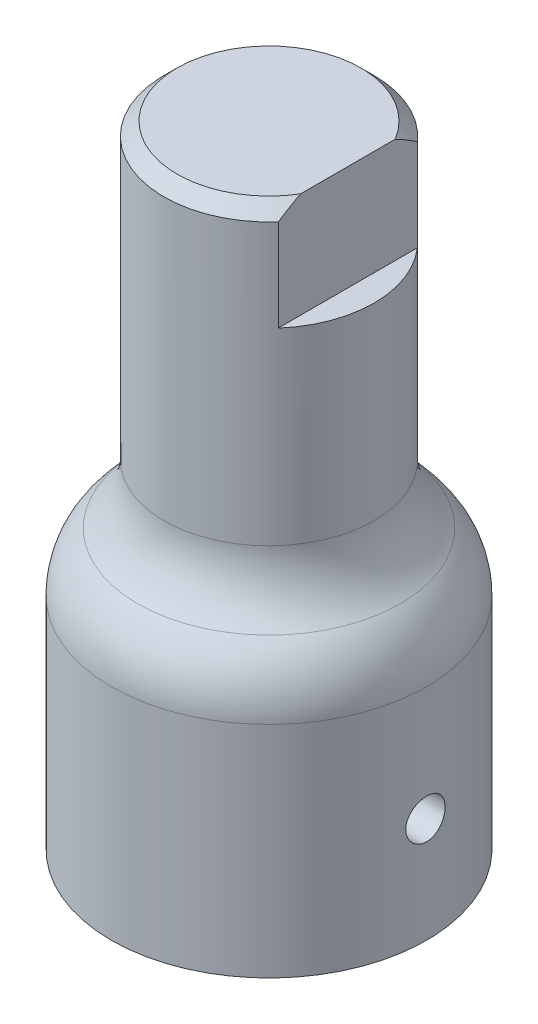
ISO-10303-21;
HEADER;
FILE_DESCRIPTION(('STEP AP214'),'2;1');
FILE_NAME('part.step','',(''),(''),'','','');
FILE_SCHEMA(('AUTOMOTIVE_DESIGN { 1 0 10303 214 1 1 1 1 }'));
ENDSEC;
DATA;
#1=APPLICATION_CONTEXT('core data for automotive mechanical design processes');
#2=APPLICATION_PROTOCOL_DEFINITION('international standard','automotive_design',2000,#1);
#3=PRODUCT_CONTEXT('',#1,'mechanical');
#4=PRODUCT('Part','Part','',(#3));
#5=PRODUCT_RELATED_PRODUCT_CATEGORY('part','',(#4));
#6=PRODUCT_DEFINITION_FORMATION('','',#4);
#7=PRODUCT_DEFINITION_CONTEXT('part definition',#1,'design');
#8=PRODUCT_DEFINITION('design','',#6,#7);
#9=PRODUCT_DEFINITION_SHAPE('','',#8);
#10=(LENGTH_UNIT() NAMED_UNIT(*) SI_UNIT(.MILLI.,.METRE.));
#11=(NAMED_UNIT(*) PLANE_ANGLE_UNIT() SI_UNIT($,.RADIAN.));
#12=(NAMED_UNIT(*) SI_UNIT($,.STERADIAN.) SOLID_ANGLE_UNIT());
#13=UNCERTAINTY_MEASURE_WITH_UNIT(LENGTH_MEASURE(1.E-05),#10,'distance_accuracy_value','');
#14=(GEOMETRIC_REPRESENTATION_CONTEXT(3) GLOBAL_UNCERTAINTY_ASSIGNED_CONTEXT((#13)) GLOBAL_UNIT_ASSIGNED_CONTEXT((#10,
#11,#12)) REPRESENTATION_CONTEXT('',''));
#15=CARTESIAN_POINT('',(0.,0.,0.));
#16=DIRECTION('',(0.,0.,1.));
#17=DIRECTION('',(1.,0.,0.));
#18=AXIS2_PLACEMENT_3D('',#15,#16,#17);
#19=CARTESIAN_POINT('',(0.,38.1,0.));
#20=DIRECTION('',(0.,-1.,0.));
#21=DIRECTION('',(0.,0.,-1.));
#22=AXIS2_PLACEMENT_3D('',#19,#20,#21);
#23=CYLINDRICAL_SURFACE('',#22,6.35);
#24=CARTESIAN_POINT('',(0.,20.3651280605346,0.));
#25=DIRECTION('',(0.,-1.,0.));
#26=DIRECTION('',(0.,0.,-1.));
#27=AXIS2_PLACEMENT_3D('',#24,#25,#26);
#28=CIRCLE('',#27,6.35);
#29=CARTESIAN_POINT('',(0.,20.3651280605346,-6.35));
#30=VERTEX_POINT('',#29);
#31=EDGE_CURVE('E149',#30,#30,#28,.F.);
#32=ORIENTED_EDGE('',*,*,#31,.T.);
#33=EDGE_LOOP('',(#32));
#34=FACE_BOUND('',#33,.T.);
#35=DIRECTION('',(0.,1.,0.));
#36=VECTOR('',#35,1.);
#37=CARTESIAN_POINT('',(4.7625,31.75,4.20013020631504));
#38=LINE('',#37,#36);
#39=CARTESIAN_POINT('',(4.7625,31.75,4.20013020631504));
#40=VERTEX_POINT('',#39);
#41=CARTESIAN_POINT('',(4.7625,37.30625,4.20013020631504));
#42=VERTEX_POINT('',#41);
#43=EDGE_CURVE('E82',#40,#42,#38,.T.);
#44=ORIENTED_EDGE('',*,*,#43,.T.);
#45=CARTESIAN_POINT('',(0.,37.30625,0.));
#46=DIRECTION('',(0.,1.,0.));
#47=DIRECTION('',(0.,0.,1.));
#48=AXIS2_PLACEMENT_3D('',#45,#46,#47);
#49=CIRCLE('',#48,6.35);
#50=CARTESIAN_POINT('',(4.7625,37.30625,-4.20013020631504));
#51=VERTEX_POINT('',#50);
#52=EDGE_CURVE('E11',#42,#51,#49,.F.);
#53=ORIENTED_EDGE('',*,*,#52,.T.);
#54=DIRECTION('',(0.,1.,0.));
#55=VECTOR('',#54,1.);
#56=CARTESIAN_POINT('',(4.7625,31.75,-4.20013020631504));
#57=LINE('',#56,#55);
#58=CARTESIAN_POINT('',(4.7625,31.75,-4.20013020631504));
#59=VERTEX_POINT('',#58);
#60=EDGE_CURVE('E80',#59,#51,#57,.T.);
#61=ORIENTED_EDGE('',*,*,#60,.F.);
#62=CARTESIAN_POINT('',(0.,31.75,0.));
#63=DIRECTION('',(0.,1.,0.));
#64=DIRECTION('',(0.,0.,1.));
#65=AXIS2_PLACEMENT_3D('',#62,#63,#64);
#66=CIRCLE('',#65,6.35);
#67=EDGE_CURVE('E85',#40,#59,#66,.T.);
#68=ORIENTED_EDGE('',*,*,#67,.F.);
#69=EDGE_LOOP('',(#44,#53,#61,#68));
#70=FACE_BOUND('',#69,.T.);
#71=ADVANCED_FACE('F35',(#34,#70),#23,.T.);
#72=CARTESIAN_POINT('',(0.,38.1,0.));
#73=DIRECTION('',(0.,1.,0.));
#74=DIRECTION('',(0.,0.,1.));
#75=AXIS2_PLACEMENT_3D('',#72,#73,#74);
#76=PLANE('',#75);
#77=DIRECTION('',(0.,0.,-1.));
#78=VECTOR('',#77,1.);
#79=CARTESIAN_POINT('',(4.7625,38.1,4.20013020631504));
#80=LINE('',#79,#78);
#81=CARTESIAN_POINT('',(4.7625,38.1,2.86190632489952));
#82=VERTEX_POINT('',#81);
#83=CARTESIAN_POINT('',(4.7625,38.1,-2.86190632489951));
#84=VERTEX_POINT('',#83);
#85=EDGE_CURVE('E88',#82,#84,#80,.T.);
#86=ORIENTED_EDGE('',*,*,#85,.T.);
#87=CARTESIAN_POINT('',(0.,38.1,0.));
#88=DIRECTION('',(0.,1.,0.));
#89=DIRECTION('',(0.,0.,1.));
#90=AXIS2_PLACEMENT_3D('',#87,#88,#89);
#91=CIRCLE('',#90,5.55624999999999);
#92=EDGE_CURVE('E165',#84,#82,#91,.T.);
#93=ORIENTED_EDGE('',*,*,#92,.T.);
#94=EDGE_LOOP('',(#86,#93));
#95=FACE_BOUND('',#94,.T.);
#96=ADVANCED_FACE('F141',(#95),#76,.T.);
#97=CARTESIAN_POINT('',(0.,0.,0.));
#98=DIRECTION('',(0.,1.,0.));
#99=DIRECTION('',(0.,0.,1.));
#100=AXIS2_PLACEMENT_3D('',#97,#98,#99);
#101=PLANE('',#100);
#102=CARTESIAN_POINT('',(0.,0.,0.));
#103=DIRECTION('',(0.,1.,0.));
#104=DIRECTION('',(0.,0.,1.));
#105=AXIS2_PLACEMENT_3D('',#102,#103,#104);
#106=CIRCLE('',#105,9.525);
#107=CARTESIAN_POINT('',(0.,0.,9.525));
#108=VERTEX_POINT('',#107);
#109=EDGE_CURVE('E152',#108,#108,#106,.T.);
#110=ORIENTED_EDGE('',*,*,#109,.F.);
#111=EDGE_LOOP('',(#110));
#112=FACE_BOUND('',#111,.T.);
#113=CARTESIAN_POINT('',(0.,0.,0.));
#114=DIRECTION('',(0.,1.,0.));
#115=DIRECTION('',(0.,0.,1.));
#116=AXIS2_PLACEMENT_3D('',#113,#114,#115);
#117=CIRCLE('',#116,6.35);
#118=CARTESIAN_POINT('',(4.7625,0.,-4.20013020631504));
#119=VERTEX_POINT('',#118);
#120=CARTESIAN_POINT('',(4.7625,0.,4.20013020631504));
#121=VERTEX_POINT('',#120);
#122=EDGE_CURVE('E103',#119,#121,#117,.T.);
#123=ORIENTED_EDGE('',*,*,#122,.T.);
#124=DIRECTION('',(0.,0.,-1.));
#125=VECTOR('',#124,1.);
#126=CARTESIAN_POINT('',(4.7625,0.,4.20013020631504));
#127=LINE('',#126,#125);
#128=EDGE_CURVE('E278',#121,#119,#127,.T.);
#129=ORIENTED_EDGE('',*,*,#128,.T.);
#130=EDGE_LOOP('',(#123,#129));
#131=FACE_BOUND('',#130,.T.);
#132=ADVANCED_FACE('F138',(#112,#131),#101,.F.);
#133=CARTESIAN_POINT('',(0.,15.875,0.));
#134=DIRECTION('',(0.,-1.,0.));
#135=DIRECTION('',(0.,0.,-1.));
#136=AXIS2_PLACEMENT_3D('',#133,#134,#135);
#137=CYLINDRICAL_SURFACE('',#136,9.525);
#138=CARTESIAN_POINT('',(9.525,5.159375,0.));
#139=CARTESIAN_POINT('',(9.52499907081924,5.15937782937064,0.0665993217584333));
#140=CARTESIAN_POINT('',(9.52429412394272,5.16498183370437,0.133240259761685));
#141=CARTESIAN_POINT('',(9.52154975978035,5.18724884311434,0.264667746995247));
#142=CARTESIAN_POINT('',(9.51950894913981,5.20392339543601,0.32945228620956));
#143=CARTESIAN_POINT('',(9.51432276572398,5.24783255291408,0.455245267504719));
#144=CARTESIAN_POINT('',(9.51117813655702,5.27506005016194,0.5162562192696));
#145=CARTESIAN_POINT('',(9.50413406293194,5.33928666899061,0.63283122491781));
#146=CARTESIAN_POINT('',(9.5002347479881,5.37628411431275,0.688396210941223));
#147=CARTESIAN_POINT('',(9.49209265522137,5.45921816611111,0.792819479063541));
#148=CARTESIAN_POINT('',(9.48784828372264,5.50519780785115,0.841643461301308));
#149=CARTESIAN_POINT('',(9.47950729512144,5.60469866970933,0.930903392931758));
#150=CARTESIAN_POINT('',(9.47541068555933,5.65822027401493,0.971338914756812));
#151=CARTESIAN_POINT('',(9.46781335551327,5.77150863931565,1.04280183931148));
#152=CARTESIAN_POINT('',(9.4643146875598,5.83129581844673,1.07379711069194));
#153=CARTESIAN_POINT('',(9.45833037427971,5.95527783348993,1.1252944902189));
#154=CARTESIAN_POINT('',(9.45584469053881,6.01947250215377,1.14579699627856));
#155=CARTESIAN_POINT('',(9.45218299236221,6.1500912981482,1.1756226392368));
#156=CARTESIAN_POINT('',(9.45100019611749,6.21650200898162,1.18500368539097));
#157=CARTESIAN_POINT('',(9.45005743403004,6.34996488297846,1.19249930547663));
#158=CARTESIAN_POINT('',(9.45029741096968,6.41701702023828,1.1906143324774));
#159=CARTESIAN_POINT('',(9.45216687494844,6.54945579897723,1.17567895885832));
#160=CARTESIAN_POINT('',(9.45378842328606,6.61484976217788,1.16269234837146));
#161=CARTESIAN_POINT('',(9.45822593884571,6.74252287885554,1.12602186999045));
#162=CARTESIAN_POINT('',(9.46104193026776,6.80480196919506,1.10233778535935));
#163=CARTESIAN_POINT('',(9.4675600393054,6.92467563453408,1.04487609790793));
#164=CARTESIAN_POINT('',(9.4712645849195,6.98225678424358,1.01107077457826));
#165=CARTESIAN_POINT('',(9.47914051318822,7.09095293821431,0.93434604982886));
#166=CARTESIAN_POINT('',(9.48331191719172,7.14206764654496,0.891426231533472));
#167=CARTESIAN_POINT('',(9.49168683585315,7.23675021598171,0.79733732649649));
#168=CARTESIAN_POINT('',(9.49589037311756,7.28026345495355,0.746113256233808));
#169=CARTESIAN_POINT('',(9.50382893754725,7.35808260411455,0.637059226790508));
#170=CARTESIAN_POINT('',(9.50756396363217,7.39238849307254,0.579229252377819));
#171=CARTESIAN_POINT('',(9.51414698744098,7.45081916637094,0.45856287098686));
#172=CARTESIAN_POINT('',(9.51699468708732,7.47494053041093,0.395724790529589));
#173=CARTESIAN_POINT('',(9.52147949227754,7.51227407254045,0.266846656630292));
#174=CARTESIAN_POINT('',(9.52311665449633,7.52548676135527,0.200806753245357));
#175=CARTESIAN_POINT('',(9.52498855290624,7.54055709830409,0.0678718943138049));
#176=CARTESIAN_POINT('',(9.5252325821293,7.54248999136339,0.000985594707088484));
#177=CARTESIAN_POINT('',(9.52431580975086,7.53514444165585,-0.132157487381931));
#178=CARTESIAN_POINT('',(9.52315503806674,7.52586623764643,-0.19841428324019));
#179=CARTESIAN_POINT('',(9.51956488620374,7.4964243761962,-0.328195546802373));
#180=CARTESIAN_POINT('',(9.51713968812605,7.4762965964295,-0.391728279164764));
#181=CARTESIAN_POINT('',(9.51129220626469,7.42576423852647,-0.514516523126314));
#182=CARTESIAN_POINT('',(9.50786988862572,7.39535931144346,-0.573771889410354));
#183=CARTESIAN_POINT('',(9.50038655660941,7.32495369326207,-0.686659402977385));
#184=CARTESIAN_POINT('',(9.49632233975245,7.28490432948007,-0.740260978173242));
#185=CARTESIAN_POINT('',(9.48801986532594,7.19641555179934,-0.840008316309532));
#186=CARTESIAN_POINT('',(9.4837816008531,7.14797580486547,-0.886153783157926));
#187=CARTESIAN_POINT('',(9.47558003976556,7.04374984276941,-0.969945970387078));
#188=CARTESIAN_POINT('',(9.47161844586032,6.98792337506967,-1.00754281309548));
#189=CARTESIAN_POINT('',(9.46444677006441,6.87070401088794,-1.07282593859747));
#190=CARTESIAN_POINT('',(9.46123667310901,6.80931122602431,-1.10051242006313));
#191=CARTESIAN_POINT('',(9.45594303749664,6.68286287925595,-1.14510815818519));
#192=CARTESIAN_POINT('',(9.45385656144256,6.61781736343965,-1.16204553632645));
#193=CARTESIAN_POINT('',(9.45103797450925,6.48577769209946,-1.18475283457956));
#194=CARTESIAN_POINT('',(9.4503058006243,6.41878362737453,-1.19052327420765));
#195=CARTESIAN_POINT('',(9.45028055162894,6.28524479746627,-1.1907233628104));
#196=CARTESIAN_POINT('',(9.45097753288118,6.21870013798194,-1.18523137240428));
#197=CARTESIAN_POINT('',(9.45371068298342,6.08748760464941,-1.16322843530949));
#198=CARTESIAN_POINT('',(9.45574685197692,6.02281973100231,-1.14671748744012));
#199=CARTESIAN_POINT('',(9.46092587637629,5.89720676184,-1.1031698188447));
#200=CARTESIAN_POINT('',(9.46406833493563,5.83626034055836,-1.0761368721874));
#201=CARTESIAN_POINT('',(9.47110651770345,5.71975615600949,-1.01232028714908));
#202=CARTESIAN_POINT('',(9.47500225135022,5.66419846027431,-0.97553652659144));
#203=CARTESIAN_POINT('',(9.48314050513251,5.5596482539316,-0.892971765265354));
#204=CARTESIAN_POINT('',(9.48738516580021,5.51070202422019,-0.847132366775322));
#205=CARTESIAN_POINT('',(9.49572411046119,5.42116637451375,-0.74787929559369));
#206=CARTESIAN_POINT('',(9.49981835876249,5.38057892761873,-0.69446383957867));
#207=CARTESIAN_POINT('',(9.50741235699438,5.3087815986786,-0.581342001931816));
#208=CARTESIAN_POINT('',(9.51090978693541,5.27760796494048,-0.521612469407674));
#209=CARTESIAN_POINT('',(9.5168925537279,5.22577794556112,-0.397755857220983));
#210=CARTESIAN_POINT('',(9.5193789896976,5.20511013219917,-0.333633642264448));
#211=CARTESIAN_POINT('',(9.52246025556089,5.17982549019592,-0.224316498899722));
#212=CARTESIAN_POINT('',(9.5234080195771,5.17216757888104,-0.179810884749932));
#213=CARTESIAN_POINT('',(9.52467820420526,5.1619413942386,-0.0902098763549205));
#214=CARTESIAN_POINT('',(9.52500062942852,5.15937308337983,-0.0451144864612312));
#215=CARTESIAN_POINT('',(9.525,5.159375,0.));
#216=B_SPLINE_CURVE_WITH_KNOTS('',3,(#138,#139,#140,#141,#142,#143,#144,#145,#146,#147,#148,
#149,#150,#151,#152,#153,#154,#155,#156,#157,#158,#159,#160,#161,#162,#163,#164,#165,#166,#167,
#168,#169,#170,#171,#172,#173,#174,#175,#176,#177,#178,#179,#180,#181,#182,#183,#184,#185,#186,
#187,#188,#189,#190,#191,#192,#193,#194,#195,#196,#197,#198,#199,#200,#201,#202,#203,#204,#205,
#206,#207,#208,#209,#210,#211,#212,#213,#214,#215),.UNSPECIFIED.,.T.,.F.,(4,2,2,2,2,2,2,2,2,2,2,
2,2,2,2,2,2,2,2,2,2,2,2,2,2,2,2,2,2,2,2,2,2,2,2,2,2,2,4),(0.,0.199633176159688,
0.399474909524307,0.599182273271568,0.798855394877486,0.999509747873777,1.20017432589755,
1.40151445464362,1.60284694747854,1.8031264354261,2.00339786907571,2.20252621680356,
2.40165859916672,2.60134144268485,2.8010334211962,3.00210606462468,3.2031791717012,
3.40431975217177,3.60545091505425,3.80523883060402,4.00502249144043,4.2041495191673,
4.40328330866349,4.60344394394661,4.80361252592386,5.00492063930482,5.20622471685508,
5.4069999537629,5.60776584983809,5.80713961697555,6.00651340547635,6.20581574766465,
6.40512058720716,6.60575531950734,6.80643735771344,7.00788255696301,7.20910816248271,
7.34434099068108,7.47957282165583),.UNSPECIFIED.);
#217=CARTESIAN_POINT('',(9.525,5.159375,0.));
#218=VERTEX_POINT('',#217);
#219=EDGE_CURVE('E96',#218,#218,#216,.T.);
#220=ORIENTED_EDGE('',*,*,#219,.T.);
#221=EDGE_LOOP('',(#220));
#222=FACE_BOUND('',#221,.T.);
#223=CARTESIAN_POINT('',(0.,13.2656122319727,0.));
#224=DIRECTION('',(0.,-1.,0.));
#225=DIRECTION('',(0.,0.,-1.));
#226=AXIS2_PLACEMENT_3D('',#223,#224,#225);
#227=CIRCLE('',#226,9.525);
#228=CARTESIAN_POINT('',(0.,13.2656122319727,-9.525));
#229=VERTEX_POINT('',#228);
#230=EDGE_CURVE('E155',#229,#229,#227,.T.);
#231=ORIENTED_EDGE('',*,*,#230,.T.);
#232=EDGE_LOOP('',(#231));
#233=FACE_BOUND('',#232,.T.);
#234=ORIENTED_EDGE('',*,*,#109,.T.);
#235=EDGE_LOOP('',(#234));
#236=FACE_BOUND('',#235,.T.);
#237=ADVANCED_FACE('F105',(#222,#233,#236),#137,.T.);
#238=CARTESIAN_POINT('',(0.,12.7,0.));
#239=DIRECTION('',(0.,-1.,0.));
#240=DIRECTION('',(0.,0.,-1.));
#241=AXIS2_PLACEMENT_3D('',#238,#239,#240);
#242=CYLINDRICAL_SURFACE('',#241,6.35);
#243=ORIENTED_EDGE('',*,*,#122,.F.);
#244=DIRECTION('',(0.,-1.,0.));
#245=VECTOR('',#244,1.);
#246=CARTESIAN_POINT('',(4.7625,12.7,-4.20013020631504));
#247=LINE('',#246,#245);
#248=CARTESIAN_POINT('',(4.7625,12.7,-4.20013020631504));
#249=VERTEX_POINT('',#248);
#250=EDGE_CURVE('E289',#249,#119,#247,.T.);
#251=ORIENTED_EDGE('',*,*,#250,.F.);
#252=CARTESIAN_POINT('',(0.,12.7,0.));
#253=DIRECTION('',(0.,1.,0.));
#254=DIRECTION('',(0.,0.,1.));
#255=AXIS2_PLACEMENT_3D('',#252,#253,#254);
#256=CIRCLE('',#255,6.35);
#257=CARTESIAN_POINT('',(4.7625,12.7,4.20013020631504));
#258=VERTEX_POINT('',#257);
#259=EDGE_CURVE('E281',#249,#258,#256,.T.);
#260=ORIENTED_EDGE('',*,*,#259,.T.);
#261=DIRECTION('',(0.,-1.,0.));
#262=VECTOR('',#261,1.);
#263=CARTESIAN_POINT('',(4.7625,12.7,4.20013020631504));
#264=LINE('',#263,#262);
#265=EDGE_CURVE('E158',#258,#121,#264,.T.);
#266=ORIENTED_EDGE('',*,*,#265,.T.);
#267=EDGE_LOOP('',(#243,#251,#260,#266));
#268=FACE_BOUND('',#267,.T.);
#269=ADVANCED_FACE('F131',(#268),#242,.F.);
#270=CARTESIAN_POINT('',(4.7625,12.7,4.20013020631504));
#271=DIRECTION('',(-1.,0.,0.));
#272=DIRECTION('',(0.,0.,1.));
#273=AXIS2_PLACEMENT_3D('',#270,#271,#272);
#274=PLANE('',#273);
#275=CARTESIAN_POINT('',(4.7625,6.35,0.));
#276=DIRECTION('',(-1.,0.,0.));
#277=DIRECTION('',(0.,0.,1.));
#278=AXIS2_PLACEMENT_3D('',#275,#276,#277);
#279=CIRCLE('',#278,1.190625);
#280=CARTESIAN_POINT('',(4.7625,6.35,1.190625));
#281=VERTEX_POINT('',#280);
#282=EDGE_CURVE('E91',#281,#281,#279,.T.);
#283=ORIENTED_EDGE('',*,*,#282,.F.);
#284=EDGE_LOOP('',(#283));
#285=FACE_BOUND('',#284,.T.);
#286=ORIENTED_EDGE('',*,*,#128,.F.);
#287=ORIENTED_EDGE('',*,*,#265,.F.);
#288=DIRECTION('',(0.,0.,-1.));
#289=VECTOR('',#288,1.);
#290=CARTESIAN_POINT('',(4.7625,12.7,4.20013020631504));
#291=LINE('',#290,#289);
#292=EDGE_CURVE('E285',#258,#249,#291,.T.);
#293=ORIENTED_EDGE('',*,*,#292,.T.);
#294=ORIENTED_EDGE('',*,*,#250,.T.);
#295=EDGE_LOOP('',(#286,#287,#293,#294));
#296=FACE_BOUND('',#295,.T.);
#297=ADVANCED_FACE('F128',(#285,#296),#274,.T.);
#298=CARTESIAN_POINT('',(0.,12.7,0.));
#299=DIRECTION('',(0.,1.,0.));
#300=DIRECTION('',(0.,0.,1.));
#301=AXIS2_PLACEMENT_3D('',#298,#299,#300);
#302=PLANE('',#301);
#303=ORIENTED_EDGE('',*,*,#259,.F.);
#304=ORIENTED_EDGE('',*,*,#292,.F.);
#305=EDGE_LOOP('',(#303,#304));
#306=FACE_BOUND('',#305,.T.);
#307=ADVANCED_FACE('F124',(#306),#302,.F.);
#308=CARTESIAN_POINT('',(0.,20.3651280605346,0.));
#309=DIRECTION('',(0.,-1.,0.));
#310=DIRECTION('',(0.,0.,-1.));
#311=AXIS2_PLACEMENT_3D('',#308,#309,#310);
#312=TOROIDAL_SURFACE('',#311,11.1125,4.7625);
#313=CARTESIAN_POINT('',(0.,16.8153701462537,0.));
#314=DIRECTION('',(0.,1.,0.));
#315=DIRECTION('',(0.,0.,1.));
#316=AXIS2_PLACEMENT_3D('',#313,#314,#315);
#317=CIRCLE('',#316,7.9375);
#318=CARTESIAN_POINT('',(0.,16.8153701462537,7.9375));
#319=VERTEX_POINT('',#318);
#320=EDGE_CURVE('E151',#319,#319,#317,.T.);
#321=ORIENTED_EDGE('',*,*,#320,.T.);
#322=EDGE_LOOP('',(#321));
#323=FACE_BOUND('',#322,.T.);
#324=ORIENTED_EDGE('',*,*,#31,.F.);
#325=EDGE_LOOP('',(#324));
#326=FACE_BOUND('',#325,.T.);
#327=ADVANCED_FACE('F120',(#323,#326),#312,.F.);
#328=CARTESIAN_POINT('',(0.,13.2656122319727,0.));
#329=DIRECTION('',(0.,-1.,0.));
#330=DIRECTION('',(0.,0.,-1.));
#331=AXIS2_PLACEMENT_3D('',#328,#329,#330);
#332=DEGENERATE_TOROIDAL_SURFACE('',#331,4.7625,4.7625,.T.);
#333=ORIENTED_EDGE('',*,*,#230,.F.);
#334=EDGE_LOOP('',(#333));
#335=FACE_BOUND('',#334,.T.);
#336=ORIENTED_EDGE('',*,*,#320,.F.);
#337=EDGE_LOOP('',(#336));
#338=FACE_BOUND('',#337,.T.);
#339=ADVANCED_FACE('F114',(#335,#338),#332,.T.);
#340=CARTESIAN_POINT('',(9.525,6.35,0.));
#341=DIRECTION('',(-1.,0.,0.));
#342=DIRECTION('',(0.,0.,1.));
#343=AXIS2_PLACEMENT_3D('',#340,#341,#342);
#344=CYLINDRICAL_SURFACE('',#343,1.190625);
#345=ORIENTED_EDGE('',*,*,#282,.T.);
#346=EDGE_LOOP('',(#345));
#347=FACE_BOUND('',#346,.T.);
#348=ORIENTED_EDGE('',*,*,#219,.F.);
#349=EDGE_LOOP('',(#348));
#350=FACE_BOUND('',#349,.T.);
#351=ADVANCED_FACE('F109',(#347,#350),#344,.F.);
#352=CARTESIAN_POINT('',(4.7625,31.75,4.20013020631504));
#353=DIRECTION('',(1.,0.,0.));
#354=DIRECTION('',(0.,0.,-1.));
#355=AXIS2_PLACEMENT_3D('',#352,#353,#354);
#356=PLANE('',#355);
#357=ORIENTED_EDGE('',*,*,#85,.F.);
#358=CARTESIAN_POINT('',(4.7625,38.1,2.86190632489952));
#359=CARTESIAN_POINT('',(4.7625,38.0405523803319,2.97728473468103));
#360=CARTESIAN_POINT('',(4.7625,37.9790569609474,3.09158529699657));
#361=CARTESIAN_POINT('',(4.7625,37.8525824129198,3.31813666600112));
#362=CARTESIAN_POINT('',(4.7625,37.7876058580941,3.43038890701487));
#363=CARTESIAN_POINT('',(4.7625,37.6547025930422,3.6531005161684));
#364=CARTESIAN_POINT('',(4.7625,37.5867763300089,3.76356015261344));
#365=CARTESIAN_POINT('',(4.7625,37.4483372325312,3.98296117478161));
#366=CARTESIAN_POINT('',(4.7625,37.3778225485784,4.09190139499944));
#367=CARTESIAN_POINT('',(4.7625,37.30625,4.20013020631504));
#368=B_SPLINE_CURVE_WITH_KNOTS('',3,(#358,#359,#360,#361,#362,#363,#364,#365,#366,#367),
.UNSPECIFIED.,.F.,.F.,(4,2,2,2,4),(0.,0.389329079905573,0.778374174152335,1.1673604914207,
1.55663037919007),.UNSPECIFIED.);
#369=EDGE_CURVE('E42',#82,#42,#368,.T.);
#370=ORIENTED_EDGE('',*,*,#369,.T.);
#371=ORIENTED_EDGE('',*,*,#43,.F.);
#372=DIRECTION('',(0.,0.,-1.));
#373=VECTOR('',#372,1.);
#374=CARTESIAN_POINT('',(4.7625,31.75,4.20013020631504));
#375=LINE('',#374,#373);
#376=EDGE_CURVE('E77',#40,#59,#375,.T.);
#377=ORIENTED_EDGE('',*,*,#376,.T.);
#378=ORIENTED_EDGE('',*,*,#60,.T.);
#379=CARTESIAN_POINT('',(4.7625,37.30625,-4.20013020631504));
#380=CARTESIAN_POINT('',(4.7625,37.3778225485784,-4.09190139499943));
#381=CARTESIAN_POINT('',(4.7625,37.4483372325312,-3.98296117478161));
#382=CARTESIAN_POINT('',(4.7625,37.5867763300089,-3.76356015261344));
#383=CARTESIAN_POINT('',(4.7625,37.6547025930422,-3.65310051616839));
#384=CARTESIAN_POINT('',(4.7625,37.7876058580941,-3.43038890701487));
#385=CARTESIAN_POINT('',(4.7625,37.8525824129198,-3.31813666600112));
#386=CARTESIAN_POINT('',(4.7625,37.9790569609474,-3.09158529699657));
#387=CARTESIAN_POINT('',(4.7625,38.0405523803319,-2.97728473468102));
#388=CARTESIAN_POINT('',(4.7625,38.1,-2.86190632489951));
#389=B_SPLINE_CURVE_WITH_KNOTS('',3,(#379,#380,#381,#382,#383,#384,#385,#386,#387,#388),
.UNSPECIFIED.,.F.,.F.,(4,2,2,2,4),(0.,0.389269887769375,0.778256205037737,1.1673012992845,
1.55663037919007),.UNSPECIFIED.);
#390=EDGE_CURVE('E168',#51,#84,#389,.T.);
#391=ORIENTED_EDGE('',*,*,#390,.T.);
#392=EDGE_LOOP('',(#357,#370,#371,#377,#378,#391));
#393=FACE_BOUND('',#392,.T.);
#394=ADVANCED_FACE('F79',(#393),#356,.T.);
#395=CARTESIAN_POINT('',(0.,31.75,0.));
#396=DIRECTION('',(0.,1.,0.));
#397=DIRECTION('',(0.,0.,1.));
#398=AXIS2_PLACEMENT_3D('',#395,#396,#397);
#399=PLANE('',#398);
#400=ORIENTED_EDGE('',*,*,#67,.T.);
#401=ORIENTED_EDGE('',*,*,#376,.F.);
#402=EDGE_LOOP('',(#400,#401));
#403=FACE_BOUND('',#402,.T.);
#404=ADVANCED_FACE('F87',(#403),#399,.T.);
#405=CARTESIAN_POINT('',(0.,38.1,0.));
#406=DIRECTION('',(0.,-1.,0.));
#407=DIRECTION('',(0.,0.,-1.));
#408=AXIS2_PLACEMENT_3D('',#405,#406,#407);
#409=CONICAL_SURFACE('',#408,5.55624999999999,0.785398163397455);
#410=ORIENTED_EDGE('',*,*,#390,.F.);
#411=ORIENTED_EDGE('',*,*,#52,.F.);
#412=ORIENTED_EDGE('',*,*,#369,.F.);
#413=ORIENTED_EDGE('',*,*,#92,.F.);
#414=EDGE_LOOP('',(#410,#411,#412,#413));
#415=FACE_BOUND('',#414,.T.);
#416=ADVANCED_FACE('F176',(#415),#409,.T.);
#417=CLOSED_SHELL('',(#71,#96,#132,#237,#269,#297,#307,#327,#339,#351,#394,#404,#416));
#418=MANIFOLD_SOLID_BREP('B2',#417);
#419=ADVANCED_BREP_SHAPE_REPRESENTATION('',(#18,#418),#14);
#420=SHAPE_DEFINITION_REPRESENTATION(#9,#419);
ENDSEC;
END-ISO-10303-21;
